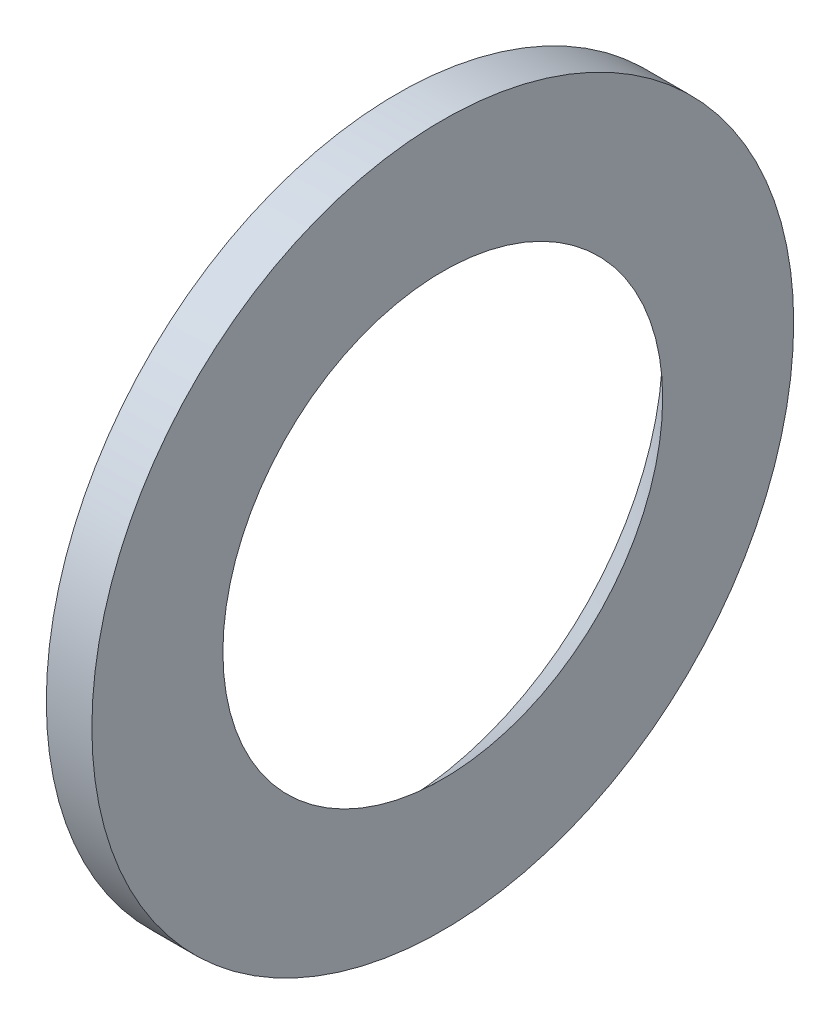
ISO-10303-21;
HEADER;
FILE_DESCRIPTION(('STEP AP214'),'2;1');
FILE_NAME('part.step','',(''),(''),'','','');
FILE_SCHEMA(('AUTOMOTIVE_DESIGN { 1 0 10303 214 1 1 1 1 }'));
ENDSEC;
DATA;
#1=APPLICATION_CONTEXT('core data for automotive mechanical design processes');
#2=APPLICATION_PROTOCOL_DEFINITION('international standard','automotive_design',2000,#1);
#3=PRODUCT_CONTEXT('',#1,'mechanical');
#4=PRODUCT('Part','Part','',(#3));
#5=PRODUCT_RELATED_PRODUCT_CATEGORY('part','',(#4));
#6=PRODUCT_DEFINITION_FORMATION('','',#4);
#7=PRODUCT_DEFINITION_CONTEXT('part definition',#1,'design');
#8=PRODUCT_DEFINITION('design','',#6,#7);
#9=PRODUCT_DEFINITION_SHAPE('','',#8);
#10=(LENGTH_UNIT() NAMED_UNIT(*) SI_UNIT(.MILLI.,.METRE.));
#11=(NAMED_UNIT(*) PLANE_ANGLE_UNIT() SI_UNIT($,.RADIAN.));
#12=(NAMED_UNIT(*) SI_UNIT($,.STERADIAN.) SOLID_ANGLE_UNIT());
#13=UNCERTAINTY_MEASURE_WITH_UNIT(LENGTH_MEASURE(1.E-05),#10,'distance_accuracy_value','');
#14=(GEOMETRIC_REPRESENTATION_CONTEXT(3) GLOBAL_UNCERTAINTY_ASSIGNED_CONTEXT((#13)) GLOBAL_UNIT_ASSIGNED_CONTEXT((#10,
#11,#12)) REPRESENTATION_CONTEXT('',''));
#15=CARTESIAN_POINT('',(0.,0.,0.));
#16=DIRECTION('',(0.,0.,1.));
#17=DIRECTION('',(1.,0.,0.));
#18=AXIS2_PLACEMENT_3D('',#15,#16,#17);
#19=CARTESIAN_POINT('',(-324.05,-11.6500000000002,0.));
#20=DIRECTION('',(1.,0.,0.));
#21=DIRECTION('',(0.,0.,-1.));
#22=AXIS2_PLACEMENT_3D('',#19,#20,#21);
#23=PLANE('',#22);
#24=CARTESIAN_POINT('',(-324.05,0.,0.));
#25=DIRECTION('',(1.,0.,0.));
#26=DIRECTION('',(0.,0.,-1.));
#27=AXIS2_PLACEMENT_3D('',#24,#25,#26);
#28=CIRCLE('',#27,15.4000000000002);
#29=CARTESIAN_POINT('',(-324.05,0.,-15.4000000000002));
#30=VERTEX_POINT('',#29);
#31=EDGE_CURVE('E10',#30,#30,#28,.T.);
#32=ORIENTED_EDGE('',*,*,#31,.F.);
#33=EDGE_LOOP('',(#32));
#34=FACE_BOUND('',#33,.T.);
#35=CARTESIAN_POINT('',(-324.05,0.,0.));
#36=DIRECTION('',(1.,0.,0.));
#37=DIRECTION('',(0.,0.,-1.));
#38=AXIS2_PLACEMENT_3D('',#35,#36,#37);
#39=CIRCLE('',#38,11.6500000000002);
#40=CARTESIAN_POINT('',(-324.05,0.,-11.6500000000002));
#41=VERTEX_POINT('',#40);
#42=EDGE_CURVE('E48',#41,#41,#39,.T.);
#43=ORIENTED_EDGE('',*,*,#42,.T.);
#44=EDGE_LOOP('',(#43));
#45=FACE_BOUND('',#44,.T.);
#46=ADVANCED_FACE('F34',(#34,#45),#23,.F.);
#47=CARTESIAN_POINT('',(-67.4822610575465,0.,0.));
#48=DIRECTION('',(1.,0.,0.));
#49=DIRECTION('',(0.,0.,-1.));
#50=AXIS2_PLACEMENT_3D('',#47,#48,#49);
#51=CYLINDRICAL_SURFACE('',#50,15.4000000000002);
#52=CARTESIAN_POINT('',(-322.05,0.,0.));
#53=DIRECTION('',(1.,0.,0.));
#54=DIRECTION('',(0.,0.,-1.));
#55=AXIS2_PLACEMENT_3D('',#52,#53,#54);
#56=CIRCLE('',#55,15.4000000000002);
#57=CARTESIAN_POINT('',(-322.05,0.,-15.4000000000002));
#58=VERTEX_POINT('',#57);
#59=EDGE_CURVE('E40',#58,#58,#56,.T.);
#60=ORIENTED_EDGE('',*,*,#59,.F.);
#61=EDGE_LOOP('',(#60));
#62=FACE_BOUND('',#61,.T.);
#63=ORIENTED_EDGE('',*,*,#31,.T.);
#64=EDGE_LOOP('',(#63));
#65=FACE_BOUND('',#64,.T.);
#66=ADVANCED_FACE('F63',(#62,#65),#51,.T.);
#67=CARTESIAN_POINT('',(-322.05,-15.4000000000001,0.));
#68=DIRECTION('',(-1.,0.,0.));
#69=DIRECTION('',(0.,0.,1.));
#70=AXIS2_PLACEMENT_3D('',#67,#68,#69);
#71=PLANE('',#70);
#72=CARTESIAN_POINT('',(-322.05,0.,0.));
#73=DIRECTION('',(1.,0.,0.));
#74=DIRECTION('',(0.,0.,-1.));
#75=AXIS2_PLACEMENT_3D('',#72,#73,#74);
#76=CIRCLE('',#75,9.65000000000021);
#77=CARTESIAN_POINT('',(-322.05,0.,-9.65000000000021));
#78=VERTEX_POINT('',#77);
#79=EDGE_CURVE('E44',#78,#78,#76,.T.);
#80=ORIENTED_EDGE('',*,*,#79,.F.);
#81=EDGE_LOOP('',(#80));
#82=FACE_BOUND('',#81,.T.);
#83=ORIENTED_EDGE('',*,*,#59,.T.);
#84=EDGE_LOOP('',(#83));
#85=FACE_BOUND('',#84,.T.);
#86=ADVANCED_FACE('F58',(#82,#85),#71,.F.);
#87=CARTESIAN_POINT('',(-322.05,0.,0.));
#88=DIRECTION('',(-1.,0.,0.));
#89=DIRECTION('',(0.,0.,1.));
#90=AXIS2_PLACEMENT_3D('',#87,#88,#89);
#91=CONICAL_SURFACE('',#90,9.65000000000021,0.785398163397454);
#92=ORIENTED_EDGE('',*,*,#42,.F.);
#93=EDGE_LOOP('',(#92));
#94=FACE_BOUND('',#93,.T.);
#95=ORIENTED_EDGE('',*,*,#79,.T.);
#96=EDGE_LOOP('',(#95));
#97=FACE_BOUND('',#96,.T.);
#98=ADVANCED_FACE('F55',(#94,#97),#91,.F.);
#99=CLOSED_SHELL('',(#46,#66,#86,#98));
#100=MANIFOLD_SOLID_BREP('B2',#99);
#101=ADVANCED_BREP_SHAPE_REPRESENTATION('',(#18,#100),#14);
#102=SHAPE_DEFINITION_REPRESENTATION(#9,#101);
ENDSEC;
END-ISO-10303-21;
